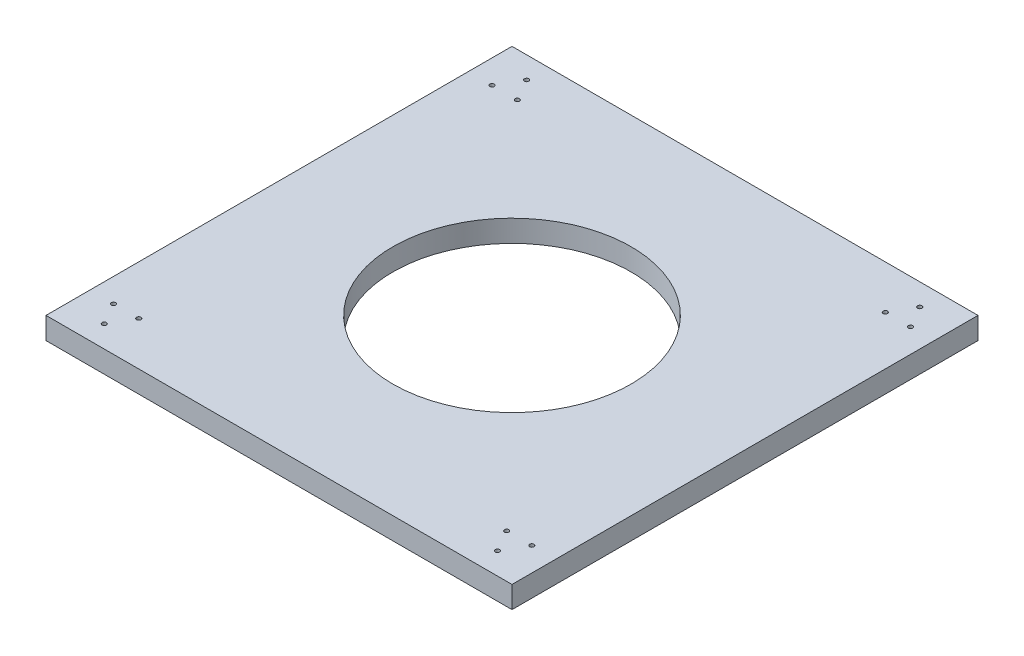
ISO-10303-21;
HEADER;
FILE_DESCRIPTION(('STEP AP214'),'2;1');
FILE_NAME('part.step','',(''),(''),'','','');
FILE_SCHEMA(('AUTOMOTIVE_DESIGN { 1 0 10303 214 1 1 1 1 }'));
ENDSEC;
DATA;
#1=APPLICATION_CONTEXT('core data for automotive mechanical design processes');
#2=APPLICATION_PROTOCOL_DEFINITION('international standard','automotive_design',2000,#1);
#3=PRODUCT_CONTEXT('',#1,'mechanical');
#4=PRODUCT('Part','Part','',(#3));
#5=PRODUCT_RELATED_PRODUCT_CATEGORY('part','',(#4));
#6=PRODUCT_DEFINITION_FORMATION('','',#4);
#7=PRODUCT_DEFINITION_CONTEXT('part definition',#1,'design');
#8=PRODUCT_DEFINITION('design','',#6,#7);
#9=PRODUCT_DEFINITION_SHAPE('','',#8);
#10=(LENGTH_UNIT() NAMED_UNIT(*) SI_UNIT(.MILLI.,.METRE.));
#11=(NAMED_UNIT(*) PLANE_ANGLE_UNIT() SI_UNIT($,.RADIAN.));
#12=(NAMED_UNIT(*) SI_UNIT($,.STERADIAN.) SOLID_ANGLE_UNIT());
#13=UNCERTAINTY_MEASURE_WITH_UNIT(LENGTH_MEASURE(1.E-05),#10,'distance_accuracy_value','');
#14=(GEOMETRIC_REPRESENTATION_CONTEXT(3) GLOBAL_UNCERTAINTY_ASSIGNED_CONTEXT((#13)) GLOBAL_UNIT_ASSIGNED_CONTEXT((#10,
#11,#12)) REPRESENTATION_CONTEXT('',''));
#15=CARTESIAN_POINT('',(0.,0.,0.));
#16=DIRECTION('',(0.,0.,1.));
#17=DIRECTION('',(1.,0.,0.));
#18=AXIS2_PLACEMENT_3D('',#15,#16,#17);
#19=CARTESIAN_POINT('',(0.,15.,0.));
#20=DIRECTION('',(0.,1.,0.));
#21=DIRECTION('',(0.,0.,1.));
#22=AXIS2_PLACEMENT_3D('',#19,#20,#21);
#23=PLANE('',#22);
#24=CARTESIAN_POINT('',(276.210115079477,15.,228.505355986472));
#25=DIRECTION('',(0.,1.,0.));
#26=DIRECTION('',(0.,0.,-1.));
#27=AXIS2_PLACEMENT_3D('',#24,#25,#26);
#28=CIRCLE('',#27,1.49999999999999);
#29=CARTESIAN_POINT('',(276.210115079477,15.,227.005355986472));
#30=VERTEX_POINT('',#29);
#31=EDGE_CURVE('E175',#30,#30,#28,.T.);
#32=ORIENTED_EDGE('',*,*,#31,.F.);
#33=EDGE_LOOP('',(#32));
#34=FACE_BOUND('',#33,.T.);
#35=CARTESIAN_POINT('',(-2.45013895836724,15.,243.505355986472));
#36=DIRECTION('',(0.,1.,0.));
#37=DIRECTION('',(0.,0.,1.));
#38=AXIS2_PLACEMENT_3D('',#35,#36,#37);
#39=CIRCLE('',#38,1.5);
#40=CARTESIAN_POINT('',(-2.45013895836724,15.,245.005355986472));
#41=VERTEX_POINT('',#40);
#42=EDGE_CURVE('E163',#41,#41,#39,.T.);
#43=ORIENTED_EDGE('',*,*,#42,.F.);
#44=EDGE_LOOP('',(#43));
#45=FACE_BOUND('',#44,.T.);
#46=CARTESIAN_POINT('',(276.210115079477,15.,-31.4946440135279));
#47=DIRECTION('',(0.,1.,0.));
#48=DIRECTION('',(0.,0.,1.));
#49=AXIS2_PLACEMENT_3D('',#46,#47,#48);
#50=CIRCLE('',#49,1.49999999999999);
#51=CARTESIAN_POINT('',(276.210115079477,15.,-29.9946440135279));
#52=VERTEX_POINT('',#51);
#53=EDGE_CURVE('E151',#52,#52,#50,.T.);
#54=ORIENTED_EDGE('',*,*,#53,.F.);
#55=EDGE_LOOP('',(#54));
#56=FACE_BOUND('',#55,.T.);
#57=CARTESIAN_POINT('',(267.549861041633,15.,-46.4946440135277));
#58=DIRECTION('',(0.,1.,0.));
#59=DIRECTION('',(0.,0.,1.));
#60=AXIS2_PLACEMENT_3D('',#57,#58,#59);
#61=CIRCLE('',#60,1.50000000000002);
#62=CARTESIAN_POINT('',(267.549861041633,15.,-44.9946440135277));
#63=VERTEX_POINT('',#62);
#64=EDGE_CURVE('E139',#63,#63,#61,.T.);
#65=ORIENTED_EDGE('',*,*,#64,.F.);
#66=EDGE_LOOP('',(#65));
#67=FACE_BOUND('',#66,.T.);
#68=CARTESIAN_POINT('',(-2.45013895836746,15.,-46.4946440135277));
#69=DIRECTION('',(0.,1.,0.));
#70=DIRECTION('',(0.,0.,-1.));
#71=AXIS2_PLACEMENT_3D('',#68,#69,#70);
#72=CIRCLE('',#71,1.5);
#73=CARTESIAN_POINT('',(-2.45013895836746,15.,-47.9946440135277));
#74=VERTEX_POINT('',#73);
#75=EDGE_CURVE('E127',#74,#74,#72,.T.);
#76=ORIENTED_EDGE('',*,*,#75,.F.);
#77=EDGE_LOOP('',(#76));
#78=FACE_BOUND('',#77,.T.);
#79=CARTESIAN_POINT('',(6.21011507947661,15.,-31.4946440135275));
#80=DIRECTION('',(0.,1.,0.));
#81=DIRECTION('',(0.,0.,-1.));
#82=AXIS2_PLACEMENT_3D('',#79,#80,#81);
#83=CIRCLE('',#82,1.49999999999999);
#84=CARTESIAN_POINT('',(6.21011507947661,15.,-32.9946440135275));
#85=VERTEX_POINT('',#84);
#86=EDGE_CURVE('E115',#85,#85,#83,.T.);
#87=ORIENTED_EDGE('',*,*,#86,.F.);
#88=EDGE_LOOP('',(#87));
#89=FACE_BOUND('',#88,.T.);
#90=DIRECTION('',(0.,0.,-1.));
#91=VECTOR('',#90,1.);
#92=CARTESIAN_POINT('',(292.549861041632,15.,-61.4946440135277));
#93=LINE('',#92,#91);
#94=CARTESIAN_POINT('',(292.549861041632,15.,258.505355986472));
#95=VERTEX_POINT('',#94);
#96=CARTESIAN_POINT('',(292.549861041632,15.,-61.4946440135277));
#97=VERTEX_POINT('',#96);
#98=EDGE_CURVE('E85',#95,#97,#93,.T.);
#99=ORIENTED_EDGE('',*,*,#98,.T.);
#100=DIRECTION('',(-1.,0.,0.));
#101=VECTOR('',#100,1.);
#102=CARTESIAN_POINT('',(-27.4501389583675,15.,-61.4946440135277));
#103=LINE('',#102,#101);
#104=CARTESIAN_POINT('',(-27.4501389583675,15.,-61.4946440135277));
#105=VERTEX_POINT('',#104);
#106=EDGE_CURVE('E80',#97,#105,#103,.T.);
#107=ORIENTED_EDGE('',*,*,#106,.T.);
#108=DIRECTION('',(0.,0.,1.));
#109=VECTOR('',#108,1.);
#110=CARTESIAN_POINT('',(-27.4501389583675,15.,-61.4946440135277));
#111=LINE('',#110,#109);
#112=CARTESIAN_POINT('',(-27.4501389583675,15.,258.505355986472));
#113=VERTEX_POINT('',#112);
#114=EDGE_CURVE('E83',#105,#113,#111,.T.);
#115=ORIENTED_EDGE('',*,*,#114,.T.);
#116=DIRECTION('',(1.,0.,0.));
#117=VECTOR('',#116,1.);
#118=CARTESIAN_POINT('',(-27.4501389583675,15.,258.505355986472));
#119=LINE('',#118,#117);
#120=EDGE_CURVE('E50',#113,#95,#119,.T.);
#121=ORIENTED_EDGE('',*,*,#120,.T.);
#122=EDGE_LOOP('',(#99,#107,#115,#121));
#123=FACE_BOUND('',#122,.T.);
#124=CARTESIAN_POINT('',(132.549861041633,15.,98.5053559864723));
#125=DIRECTION('',(0.,1.,0.));
#126=DIRECTION('',(0.,0.,1.));
#127=AXIS2_PLACEMENT_3D('',#124,#125,#126);
#128=CIRCLE('',#127,81.7675900347993);
#129=CARTESIAN_POINT('',(132.549861041633,15.,180.272946021272));
#130=VERTEX_POINT('',#129);
#131=EDGE_CURVE('E100',#130,#130,#128,.T.);
#132=ORIENTED_EDGE('',*,*,#131,.F.);
#133=EDGE_LOOP('',(#132));
#134=FACE_BOUND('',#133,.T.);
#135=CARTESIAN_POINT('',(-11.1103929962122,15.,-31.4946440135279));
#136=DIRECTION('',(0.,1.,0.));
#137=DIRECTION('',(0.,0.,-1.));
#138=AXIS2_PLACEMENT_3D('',#135,#136,#137);
#139=CIRCLE('',#138,1.5);
#140=CARTESIAN_POINT('',(-11.1103929962122,15.,-32.9946440135279));
#141=VERTEX_POINT('',#140);
#142=EDGE_CURVE('E121',#141,#141,#139,.T.);
#143=ORIENTED_EDGE('',*,*,#142,.F.);
#144=EDGE_LOOP('',(#143));
#145=FACE_BOUND('',#144,.T.);
#146=CARTESIAN_POINT('',(-11.110392996212,15.,228.505355986472));
#147=DIRECTION('',(0.,1.,0.));
#148=DIRECTION('',(0.,0.,1.));
#149=AXIS2_PLACEMENT_3D('',#146,#147,#148);
#150=CIRCLE('',#149,1.5);
#151=CARTESIAN_POINT('',(-11.110392996212,15.,230.005355986473));
#152=VERTEX_POINT('',#151);
#153=EDGE_CURVE('E133',#152,#152,#150,.T.);
#154=ORIENTED_EDGE('',*,*,#153,.F.);
#155=EDGE_LOOP('',(#154));
#156=FACE_BOUND('',#155,.T.);
#157=CARTESIAN_POINT('',(6.21011507947683,15.,228.505355986472));
#158=DIRECTION('',(0.,1.,0.));
#159=DIRECTION('',(0.,0.,1.));
#160=AXIS2_PLACEMENT_3D('',#157,#158,#159);
#161=CIRCLE('',#160,1.49999999999999);
#162=CARTESIAN_POINT('',(6.21011507947683,15.,230.005355986472));
#163=VERTEX_POINT('',#162);
#164=EDGE_CURVE('E145',#163,#163,#161,.T.);
#165=ORIENTED_EDGE('',*,*,#164,.F.);
#166=EDGE_LOOP('',(#165));
#167=FACE_BOUND('',#166,.T.);
#168=CARTESIAN_POINT('',(258.889607003789,15.,-31.4946440135275));
#169=DIRECTION('',(0.,1.,0.));
#170=DIRECTION('',(0.,0.,1.));
#171=AXIS2_PLACEMENT_3D('',#168,#169,#170);
#172=CIRCLE('',#171,1.50000000000001);
#173=CARTESIAN_POINT('',(258.889607003789,15.,-29.9946440135275));
#174=VERTEX_POINT('',#173);
#175=EDGE_CURVE('E157',#174,#174,#172,.T.);
#176=ORIENTED_EDGE('',*,*,#175,.F.);
#177=EDGE_LOOP('',(#176));
#178=FACE_BOUND('',#177,.T.);
#179=CARTESIAN_POINT('',(258.889607003789,15.,228.505355986472));
#180=DIRECTION('',(0.,1.,0.));
#181=DIRECTION('',(0.,0.,-1.));
#182=AXIS2_PLACEMENT_3D('',#179,#180,#181);
#183=CIRCLE('',#182,1.50000000000001);
#184=CARTESIAN_POINT('',(258.889607003789,15.,227.005355986472));
#185=VERTEX_POINT('',#184);
#186=EDGE_CURVE('E169',#185,#185,#183,.T.);
#187=ORIENTED_EDGE('',*,*,#186,.F.);
#188=EDGE_LOOP('',(#187));
#189=FACE_BOUND('',#188,.T.);
#190=CARTESIAN_POINT('',(267.549861041633,15.,243.505355986472));
#191=DIRECTION('',(0.,1.,0.));
#192=DIRECTION('',(0.,0.,-1.));
#193=AXIS2_PLACEMENT_3D('',#190,#191,#192);
#194=CIRCLE('',#193,1.50000000000002);
#195=CARTESIAN_POINT('',(267.549861041633,15.,242.005355986472));
#196=VERTEX_POINT('',#195);
#197=EDGE_CURVE('E181',#196,#196,#194,.T.);
#198=ORIENTED_EDGE('',*,*,#197,.F.);
#199=EDGE_LOOP('',(#198));
#200=FACE_BOUND('',#199,.T.);
#201=ADVANCED_FACE('F33',(#34,#45,#56,#67,#78,#89,#123,#134,#145,#156,#167,#178,#189,#200),#23,.T.);
#202=CARTESIAN_POINT('',(0.,0.,0.));
#203=DIRECTION('',(0.,1.,0.));
#204=DIRECTION('',(0.,0.,1.));
#205=AXIS2_PLACEMENT_3D('',#202,#203,#204);
#206=PLANE('',#205);
#207=DIRECTION('',(0.,0.,-1.));
#208=VECTOR('',#207,1.);
#209=CARTESIAN_POINT('',(292.549861041632,0.,-61.4946440135277));
#210=LINE('',#209,#208);
#211=CARTESIAN_POINT('',(292.549861041632,0.,258.505355986472));
#212=VERTEX_POINT('',#211);
#213=CARTESIAN_POINT('',(292.549861041632,0.,-61.4946440135277));
#214=VERTEX_POINT('',#213);
#215=EDGE_CURVE('E97',#212,#214,#210,.T.);
#216=ORIENTED_EDGE('',*,*,#215,.F.);
#217=DIRECTION('',(1.,0.,0.));
#218=VECTOR('',#217,1.);
#219=CARTESIAN_POINT('',(-27.4501389583675,0.,258.505355986472));
#220=LINE('',#219,#218);
#221=CARTESIAN_POINT('',(-27.4501389583675,0.,258.505355986472));
#222=VERTEX_POINT('',#221);
#223=EDGE_CURVE('E73',#222,#212,#220,.T.);
#224=ORIENTED_EDGE('',*,*,#223,.F.);
#225=DIRECTION('',(0.,0.,1.));
#226=VECTOR('',#225,1.);
#227=CARTESIAN_POINT('',(-27.4501389583675,0.,-61.4946440135277));
#228=LINE('',#227,#226);
#229=CARTESIAN_POINT('',(-27.4501389583675,0.,-61.4946440135277));
#230=VERTEX_POINT('',#229);
#231=EDGE_CURVE('E67',#230,#222,#228,.T.);
#232=ORIENTED_EDGE('',*,*,#231,.F.);
#233=DIRECTION('',(-1.,0.,0.));
#234=VECTOR('',#233,1.);
#235=CARTESIAN_POINT('',(-27.4501389583675,0.,-61.4946440135277));
#236=LINE('',#235,#234);
#237=EDGE_CURVE('E89',#214,#230,#236,.T.);
#238=ORIENTED_EDGE('',*,*,#237,.F.);
#239=EDGE_LOOP('',(#216,#224,#232,#238));
#240=FACE_BOUND('',#239,.T.);
#241=CARTESIAN_POINT('',(132.549861041633,0.,98.5053559864723));
#242=DIRECTION('',(0.,1.,0.));
#243=DIRECTION('',(0.,0.,1.));
#244=AXIS2_PLACEMENT_3D('',#241,#242,#243);
#245=CIRCLE('',#244,81.7675900347993);
#246=CARTESIAN_POINT('',(132.549861041633,0.,180.272946021272));
#247=VERTEX_POINT('',#246);
#248=EDGE_CURVE('E112',#247,#247,#245,.T.);
#249=ORIENTED_EDGE('',*,*,#248,.T.);
#250=EDGE_LOOP('',(#249));
#251=FACE_BOUND('',#250,.T.);
#252=CARTESIAN_POINT('',(6.21011507947661,0.,-31.4946440135275));
#253=DIRECTION('',(0.,1.,0.));
#254=DIRECTION('',(0.,0.,-1.));
#255=AXIS2_PLACEMENT_3D('',#252,#253,#254);
#256=CIRCLE('',#255,1.49999999999999);
#257=CARTESIAN_POINT('',(6.21011507947661,0.,-32.9946440135275));
#258=VERTEX_POINT('',#257);
#259=EDGE_CURVE('E118',#258,#258,#256,.T.);
#260=ORIENTED_EDGE('',*,*,#259,.T.);
#261=EDGE_LOOP('',(#260));
#262=FACE_BOUND('',#261,.T.);
#263=CARTESIAN_POINT('',(-11.1103929962122,0.,-31.4946440135279));
#264=DIRECTION('',(0.,1.,0.));
#265=DIRECTION('',(0.,0.,-1.));
#266=AXIS2_PLACEMENT_3D('',#263,#264,#265);
#267=CIRCLE('',#266,1.5);
#268=CARTESIAN_POINT('',(-11.1103929962122,0.,-32.9946440135279));
#269=VERTEX_POINT('',#268);
#270=EDGE_CURVE('E124',#269,#269,#267,.T.);
#271=ORIENTED_EDGE('',*,*,#270,.T.);
#272=EDGE_LOOP('',(#271));
#273=FACE_BOUND('',#272,.T.);
#274=CARTESIAN_POINT('',(-2.45013895836746,0.,-46.4946440135277));
#275=DIRECTION('',(0.,1.,0.));
#276=DIRECTION('',(0.,0.,-1.));
#277=AXIS2_PLACEMENT_3D('',#274,#275,#276);
#278=CIRCLE('',#277,1.5);
#279=CARTESIAN_POINT('',(-2.45013895836746,0.,-47.9946440135277));
#280=VERTEX_POINT('',#279);
#281=EDGE_CURVE('E130',#280,#280,#278,.T.);
#282=ORIENTED_EDGE('',*,*,#281,.T.);
#283=EDGE_LOOP('',(#282));
#284=FACE_BOUND('',#283,.T.);
#285=CARTESIAN_POINT('',(-11.110392996212,0.,228.505355986472));
#286=DIRECTION('',(0.,1.,0.));
#287=DIRECTION('',(0.,0.,1.));
#288=AXIS2_PLACEMENT_3D('',#285,#286,#287);
#289=CIRCLE('',#288,1.5);
#290=CARTESIAN_POINT('',(-11.110392996212,0.,230.005355986473));
#291=VERTEX_POINT('',#290);
#292=EDGE_CURVE('E136',#291,#291,#289,.T.);
#293=ORIENTED_EDGE('',*,*,#292,.T.);
#294=EDGE_LOOP('',(#293));
#295=FACE_BOUND('',#294,.T.);
#296=CARTESIAN_POINT('',(267.549861041633,0.,-46.4946440135277));
#297=DIRECTION('',(0.,1.,0.));
#298=DIRECTION('',(0.,0.,1.));
#299=AXIS2_PLACEMENT_3D('',#296,#297,#298);
#300=CIRCLE('',#299,1.50000000000002);
#301=CARTESIAN_POINT('',(267.549861041633,0.,-44.9946440135277));
#302=VERTEX_POINT('',#301);
#303=EDGE_CURVE('E142',#302,#302,#300,.T.);
#304=ORIENTED_EDGE('',*,*,#303,.T.);
#305=EDGE_LOOP('',(#304));
#306=FACE_BOUND('',#305,.T.);
#307=CARTESIAN_POINT('',(6.21011507947683,0.,228.505355986472));
#308=DIRECTION('',(0.,1.,0.));
#309=DIRECTION('',(0.,0.,1.));
#310=AXIS2_PLACEMENT_3D('',#307,#308,#309);
#311=CIRCLE('',#310,1.49999999999999);
#312=CARTESIAN_POINT('',(6.21011507947683,0.,230.005355986472));
#313=VERTEX_POINT('',#312);
#314=EDGE_CURVE('E148',#313,#313,#311,.T.);
#315=ORIENTED_EDGE('',*,*,#314,.T.);
#316=EDGE_LOOP('',(#315));
#317=FACE_BOUND('',#316,.T.);
#318=CARTESIAN_POINT('',(276.210115079477,0.,-31.4946440135279));
#319=DIRECTION('',(0.,1.,0.));
#320=DIRECTION('',(0.,0.,1.));
#321=AXIS2_PLACEMENT_3D('',#318,#319,#320);
#322=CIRCLE('',#321,1.49999999999999);
#323=CARTESIAN_POINT('',(276.210115079477,0.,-29.9946440135279));
#324=VERTEX_POINT('',#323);
#325=EDGE_CURVE('E154',#324,#324,#322,.T.);
#326=ORIENTED_EDGE('',*,*,#325,.T.);
#327=EDGE_LOOP('',(#326));
#328=FACE_BOUND('',#327,.T.);
#329=CARTESIAN_POINT('',(258.889607003789,0.,-31.4946440135275));
#330=DIRECTION('',(0.,1.,0.));
#331=DIRECTION('',(0.,0.,1.));
#332=AXIS2_PLACEMENT_3D('',#329,#330,#331);
#333=CIRCLE('',#332,1.50000000000001);
#334=CARTESIAN_POINT('',(258.889607003789,0.,-29.9946440135275));
#335=VERTEX_POINT('',#334);
#336=EDGE_CURVE('E160',#335,#335,#333,.T.);
#337=ORIENTED_EDGE('',*,*,#336,.T.);
#338=EDGE_LOOP('',(#337));
#339=FACE_BOUND('',#338,.T.);
#340=CARTESIAN_POINT('',(-2.45013895836724,0.,243.505355986472));
#341=DIRECTION('',(0.,1.,0.));
#342=DIRECTION('',(0.,0.,1.));
#343=AXIS2_PLACEMENT_3D('',#340,#341,#342);
#344=CIRCLE('',#343,1.5);
#345=CARTESIAN_POINT('',(-2.45013895836724,0.,245.005355986472));
#346=VERTEX_POINT('',#345);
#347=EDGE_CURVE('E166',#346,#346,#344,.T.);
#348=ORIENTED_EDGE('',*,*,#347,.T.);
#349=EDGE_LOOP('',(#348));
#350=FACE_BOUND('',#349,.T.);
#351=CARTESIAN_POINT('',(258.889607003789,0.,228.505355986472));
#352=DIRECTION('',(0.,1.,0.));
#353=DIRECTION('',(0.,0.,-1.));
#354=AXIS2_PLACEMENT_3D('',#351,#352,#353);
#355=CIRCLE('',#354,1.50000000000001);
#356=CARTESIAN_POINT('',(258.889607003789,0.,227.005355986472));
#357=VERTEX_POINT('',#356);
#358=EDGE_CURVE('E172',#357,#357,#355,.T.);
#359=ORIENTED_EDGE('',*,*,#358,.T.);
#360=EDGE_LOOP('',(#359));
#361=FACE_BOUND('',#360,.T.);
#362=CARTESIAN_POINT('',(276.210115079477,0.,228.505355986472));
#363=DIRECTION('',(0.,1.,0.));
#364=DIRECTION('',(0.,0.,-1.));
#365=AXIS2_PLACEMENT_3D('',#362,#363,#364);
#366=CIRCLE('',#365,1.49999999999999);
#367=CARTESIAN_POINT('',(276.210115079477,0.,227.005355986472));
#368=VERTEX_POINT('',#367);
#369=EDGE_CURVE('E178',#368,#368,#366,.T.);
#370=ORIENTED_EDGE('',*,*,#369,.T.);
#371=EDGE_LOOP('',(#370));
#372=FACE_BOUND('',#371,.T.);
#373=CARTESIAN_POINT('',(267.549861041633,0.,243.505355986472));
#374=DIRECTION('',(0.,1.,0.));
#375=DIRECTION('',(0.,0.,-1.));
#376=AXIS2_PLACEMENT_3D('',#373,#374,#375);
#377=CIRCLE('',#376,1.50000000000002);
#378=CARTESIAN_POINT('',(267.549861041633,0.,242.005355986472));
#379=VERTEX_POINT('',#378);
#380=EDGE_CURVE('E184',#379,#379,#377,.T.);
#381=ORIENTED_EDGE('',*,*,#380,.T.);
#382=EDGE_LOOP('',(#381));
#383=FACE_BOUND('',#382,.T.);
#384=ADVANCED_FACE('F108',(#240,#251,#262,#273,#284,#295,#306,#317,#328,#339,#350,#361,#372,
#383),#206,.F.);
#385=CARTESIAN_POINT('',(292.549861041632,15.,-61.4946440135277));
#386=DIRECTION('',(-1.,0.,0.));
#387=DIRECTION('',(0.,0.,1.));
#388=AXIS2_PLACEMENT_3D('',#385,#386,#387);
#389=PLANE('',#388);
#390=ORIENTED_EDGE('',*,*,#215,.T.);
#391=DIRECTION('',(0.,-1.,0.));
#392=VECTOR('',#391,1.);
#393=CARTESIAN_POINT('',(292.549861041632,15.,-61.4946440135277));
#394=LINE('',#393,#392);
#395=EDGE_CURVE('E11',#97,#214,#394,.T.);
#396=ORIENTED_EDGE('',*,*,#395,.F.);
#397=ORIENTED_EDGE('',*,*,#98,.F.);
#398=DIRECTION('',(0.,-1.,0.));
#399=VECTOR('',#398,1.);
#400=CARTESIAN_POINT('',(292.549861041632,15.,258.505355986472));
#401=LINE('',#400,#399);
#402=EDGE_CURVE('E93',#95,#212,#401,.T.);
#403=ORIENTED_EDGE('',*,*,#402,.T.);
#404=EDGE_LOOP('',(#390,#396,#397,#403));
#405=FACE_BOUND('',#404,.T.);
#406=ADVANCED_FACE('F35',(#405),#389,.F.);
#407=CARTESIAN_POINT('',(-27.4501389583675,15.,-61.4946440135277));
#408=DIRECTION('',(0.,0.,1.));
#409=DIRECTION('',(1.,0.,0.));
#410=AXIS2_PLACEMENT_3D('',#407,#408,#409);
#411=PLANE('',#410);
#412=ORIENTED_EDGE('',*,*,#237,.T.);
#413=DIRECTION('',(0.,-1.,0.));
#414=VECTOR('',#413,1.);
#415=CARTESIAN_POINT('',(-27.4501389583675,15.,-61.4946440135277));
#416=LINE('',#415,#414);
#417=EDGE_CURVE('E42',#105,#230,#416,.T.);
#418=ORIENTED_EDGE('',*,*,#417,.F.);
#419=ORIENTED_EDGE('',*,*,#106,.F.);
#420=ORIENTED_EDGE('',*,*,#395,.T.);
#421=EDGE_LOOP('',(#412,#418,#419,#420));
#422=FACE_BOUND('',#421,.T.);
#423=ADVANCED_FACE('F88',(#422),#411,.F.);
#424=CARTESIAN_POINT('',(-27.4501389583675,15.,-61.4946440135277));
#425=DIRECTION('',(1.,0.,0.));
#426=DIRECTION('',(0.,0.,-1.));
#427=AXIS2_PLACEMENT_3D('',#424,#425,#426);
#428=PLANE('',#427);
#429=ORIENTED_EDGE('',*,*,#231,.T.);
#430=DIRECTION('',(0.,-1.,0.));
#431=VECTOR('',#430,1.);
#432=CARTESIAN_POINT('',(-27.4501389583675,15.,258.505355986472));
#433=LINE('',#432,#431);
#434=EDGE_CURVE('E90',#113,#222,#433,.T.);
#435=ORIENTED_EDGE('',*,*,#434,.F.);
#436=ORIENTED_EDGE('',*,*,#114,.F.);
#437=ORIENTED_EDGE('',*,*,#417,.T.);
#438=EDGE_LOOP('',(#429,#435,#436,#437));
#439=FACE_BOUND('',#438,.T.);
#440=ADVANCED_FACE('F91',(#439),#428,.F.);
#441=CARTESIAN_POINT('',(-27.4501389583675,15.,258.505355986472));
#442=DIRECTION('',(0.,0.,-1.));
#443=DIRECTION('',(-1.,0.,0.));
#444=AXIS2_PLACEMENT_3D('',#441,#442,#443);
#445=PLANE('',#444);
#446=ORIENTED_EDGE('',*,*,#223,.T.);
#447=ORIENTED_EDGE('',*,*,#402,.F.);
#448=ORIENTED_EDGE('',*,*,#120,.F.);
#449=ORIENTED_EDGE('',*,*,#434,.T.);
#450=EDGE_LOOP('',(#446,#447,#448,#449));
#451=FACE_BOUND('',#450,.T.);
#452=ADVANCED_FACE('F105',(#451),#445,.F.);
#453=CARTESIAN_POINT('',(132.549861041633,15.,98.5053559864723));
#454=DIRECTION('',(0.,-1.,0.));
#455=DIRECTION('',(0.,0.,-1.));
#456=AXIS2_PLACEMENT_3D('',#453,#454,#455);
#457=CYLINDRICAL_SURFACE('',#456,81.7675900347993);
#458=ORIENTED_EDGE('',*,*,#131,.T.);
#459=EDGE_LOOP('',(#458));
#460=FACE_BOUND('',#459,.T.);
#461=ORIENTED_EDGE('',*,*,#248,.F.);
#462=EDGE_LOOP('',(#461));
#463=FACE_BOUND('',#462,.T.);
#464=ADVANCED_FACE('F203',(#460,#463),#457,.F.);
#465=CARTESIAN_POINT('',(6.21011507947661,15.,-31.4946440135275));
#466=DIRECTION('',(0.,-1.,0.));
#467=DIRECTION('',(0.,0.,-1.));
#468=AXIS2_PLACEMENT_3D('',#465,#466,#467);
#469=CYLINDRICAL_SURFACE('',#468,1.49999999999999);
#470=ORIENTED_EDGE('',*,*,#86,.T.);
#471=EDGE_LOOP('',(#470));
#472=FACE_BOUND('',#471,.T.);
#473=ORIENTED_EDGE('',*,*,#259,.F.);
#474=EDGE_LOOP('',(#473));
#475=FACE_BOUND('',#474,.T.);
#476=ADVANCED_FACE('F249',(#472,#475),#469,.F.);
#477=CARTESIAN_POINT('',(-11.1103929962122,15.,-31.4946440135279));
#478=DIRECTION('',(0.,-1.,0.));
#479=DIRECTION('',(0.,0.,-1.));
#480=AXIS2_PLACEMENT_3D('',#477,#478,#479);
#481=CYLINDRICAL_SURFACE('',#480,1.5);
#482=ORIENTED_EDGE('',*,*,#142,.T.);
#483=EDGE_LOOP('',(#482));
#484=FACE_BOUND('',#483,.T.);
#485=ORIENTED_EDGE('',*,*,#270,.F.);
#486=EDGE_LOOP('',(#485));
#487=FACE_BOUND('',#486,.T.);
#488=ADVANCED_FACE('F257',(#484,#487),#481,.F.);
#489=CARTESIAN_POINT('',(-2.45013895836746,15.,-46.4946440135277));
#490=DIRECTION('',(0.,-1.,0.));
#491=DIRECTION('',(0.,0.,-1.));
#492=AXIS2_PLACEMENT_3D('',#489,#490,#491);
#493=CYLINDRICAL_SURFACE('',#492,1.5);
#494=ORIENTED_EDGE('',*,*,#75,.T.);
#495=EDGE_LOOP('',(#494));
#496=FACE_BOUND('',#495,.T.);
#497=ORIENTED_EDGE('',*,*,#281,.F.);
#498=EDGE_LOOP('',(#497));
#499=FACE_BOUND('',#498,.T.);
#500=ADVANCED_FACE('F265',(#496,#499),#493,.F.);
#501=CARTESIAN_POINT('',(-11.110392996212,15.,228.505355986472));
#502=DIRECTION('',(0.,-1.,0.));
#503=DIRECTION('',(0.,0.,-1.));
#504=AXIS2_PLACEMENT_3D('',#501,#502,#503);
#505=CYLINDRICAL_SURFACE('',#504,1.5);
#506=ORIENTED_EDGE('',*,*,#153,.T.);
#507=EDGE_LOOP('',(#506));
#508=FACE_BOUND('',#507,.T.);
#509=ORIENTED_EDGE('',*,*,#292,.F.);
#510=EDGE_LOOP('',(#509));
#511=FACE_BOUND('',#510,.T.);
#512=ADVANCED_FACE('F274',(#508,#511),#505,.F.);
#513=CARTESIAN_POINT('',(267.549861041633,15.,-46.4946440135277));
#514=DIRECTION('',(0.,-1.,0.));
#515=DIRECTION('',(0.,0.,-1.));
#516=AXIS2_PLACEMENT_3D('',#513,#514,#515);
#517=CYLINDRICAL_SURFACE('',#516,1.50000000000002);
#518=ORIENTED_EDGE('',*,*,#64,.T.);
#519=EDGE_LOOP('',(#518));
#520=FACE_BOUND('',#519,.T.);
#521=ORIENTED_EDGE('',*,*,#303,.F.);
#522=EDGE_LOOP('',(#521));
#523=FACE_BOUND('',#522,.T.);
#524=ADVANCED_FACE('F283',(#520,#523),#517,.F.);
#525=CARTESIAN_POINT('',(6.21011507947683,15.,228.505355986472));
#526=DIRECTION('',(0.,-1.,0.));
#527=DIRECTION('',(0.,0.,-1.));
#528=AXIS2_PLACEMENT_3D('',#525,#526,#527);
#529=CYLINDRICAL_SURFACE('',#528,1.49999999999999);
#530=ORIENTED_EDGE('',*,*,#164,.T.);
#531=EDGE_LOOP('',(#530));
#532=FACE_BOUND('',#531,.T.);
#533=ORIENTED_EDGE('',*,*,#314,.F.);
#534=EDGE_LOOP('',(#533));
#535=FACE_BOUND('',#534,.T.);
#536=ADVANCED_FACE('F292',(#532,#535),#529,.F.);
#537=CARTESIAN_POINT('',(276.210115079477,15.,-31.4946440135279));
#538=DIRECTION('',(0.,-1.,0.));
#539=DIRECTION('',(0.,0.,-1.));
#540=AXIS2_PLACEMENT_3D('',#537,#538,#539);
#541=CYLINDRICAL_SURFACE('',#540,1.49999999999999);
#542=ORIENTED_EDGE('',*,*,#53,.T.);
#543=EDGE_LOOP('',(#542));
#544=FACE_BOUND('',#543,.T.);
#545=ORIENTED_EDGE('',*,*,#325,.F.);
#546=EDGE_LOOP('',(#545));
#547=FACE_BOUND('',#546,.T.);
#548=ADVANCED_FACE('F301',(#544,#547),#541,.F.);
#549=CARTESIAN_POINT('',(258.889607003789,15.,-31.4946440135275));
#550=DIRECTION('',(0.,-1.,0.));
#551=DIRECTION('',(0.,0.,-1.));
#552=AXIS2_PLACEMENT_3D('',#549,#550,#551);
#553=CYLINDRICAL_SURFACE('',#552,1.50000000000001);
#554=ORIENTED_EDGE('',*,*,#175,.T.);
#555=EDGE_LOOP('',(#554));
#556=FACE_BOUND('',#555,.T.);
#557=ORIENTED_EDGE('',*,*,#336,.F.);
#558=EDGE_LOOP('',(#557));
#559=FACE_BOUND('',#558,.T.);
#560=ADVANCED_FACE('F310',(#556,#559),#553,.F.);
#561=CARTESIAN_POINT('',(-2.45013895836724,15.,243.505355986472));
#562=DIRECTION('',(0.,-1.,0.));
#563=DIRECTION('',(0.,0.,-1.));
#564=AXIS2_PLACEMENT_3D('',#561,#562,#563);
#565=CYLINDRICAL_SURFACE('',#564,1.5);
#566=ORIENTED_EDGE('',*,*,#42,.T.);
#567=EDGE_LOOP('',(#566));
#568=FACE_BOUND('',#567,.T.);
#569=ORIENTED_EDGE('',*,*,#347,.F.);
#570=EDGE_LOOP('',(#569));
#571=FACE_BOUND('',#570,.T.);
#572=ADVANCED_FACE('F319',(#568,#571),#565,.F.);
#573=CARTESIAN_POINT('',(258.889607003789,15.,228.505355986472));
#574=DIRECTION('',(0.,-1.,0.));
#575=DIRECTION('',(0.,0.,-1.));
#576=AXIS2_PLACEMENT_3D('',#573,#574,#575);
#577=CYLINDRICAL_SURFACE('',#576,1.50000000000001);
#578=ORIENTED_EDGE('',*,*,#186,.T.);
#579=EDGE_LOOP('',(#578));
#580=FACE_BOUND('',#579,.T.);
#581=ORIENTED_EDGE('',*,*,#358,.F.);
#582=EDGE_LOOP('',(#581));
#583=FACE_BOUND('',#582,.T.);
#584=ADVANCED_FACE('F328',(#580,#583),#577,.F.);
#585=CARTESIAN_POINT('',(276.210115079477,15.,228.505355986472));
#586=DIRECTION('',(0.,-1.,0.));
#587=DIRECTION('',(0.,0.,-1.));
#588=AXIS2_PLACEMENT_3D('',#585,#586,#587);
#589=CYLINDRICAL_SURFACE('',#588,1.49999999999999);
#590=ORIENTED_EDGE('',*,*,#31,.T.);
#591=EDGE_LOOP('',(#590));
#592=FACE_BOUND('',#591,.T.);
#593=ORIENTED_EDGE('',*,*,#369,.F.);
#594=EDGE_LOOP('',(#593));
#595=FACE_BOUND('',#594,.T.);
#596=ADVANCED_FACE('F337',(#592,#595),#589,.F.);
#597=CARTESIAN_POINT('',(267.549861041633,15.,243.505355986472));
#598=DIRECTION('',(0.,-1.,0.));
#599=DIRECTION('',(0.,0.,-1.));
#600=AXIS2_PLACEMENT_3D('',#597,#598,#599);
#601=CYLINDRICAL_SURFACE('',#600,1.50000000000002);
#602=ORIENTED_EDGE('',*,*,#197,.T.);
#603=EDGE_LOOP('',(#602));
#604=FACE_BOUND('',#603,.T.);
#605=ORIENTED_EDGE('',*,*,#380,.F.);
#606=EDGE_LOOP('',(#605));
#607=FACE_BOUND('',#606,.T.);
#608=ADVANCED_FACE('F190',(#604,#607),#601,.F.);
#609=CLOSED_SHELL('',(#201,#384,#406,#423,#440,#452,#464,#476,#488,#500,#512,#524,#536,#548,
#560,#572,#584,#596,#608));
#610=MANIFOLD_SOLID_BREP('B2',#609);
#611=ADVANCED_BREP_SHAPE_REPRESENTATION('',(#18,#610),#14);
#612=SHAPE_DEFINITION_REPRESENTATION(#9,#611);
ENDSEC;
END-ISO-10303-21;
